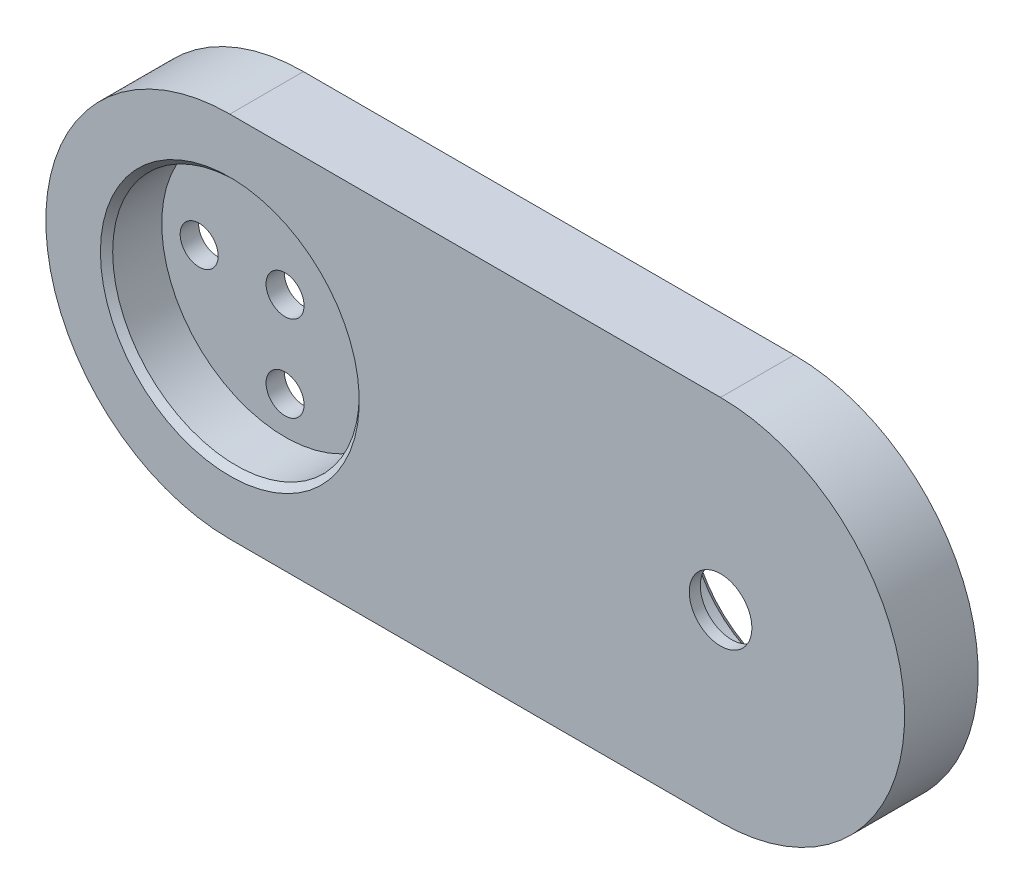
ISO-10303-21;
HEADER;
FILE_DESCRIPTION(('STEP AP214'),'2;1');
FILE_NAME('part.step','',(''),(''),'','','');
FILE_SCHEMA(('AUTOMOTIVE_DESIGN { 1 0 10303 214 1 1 1 1 }'));
ENDSEC;
DATA;
#1=APPLICATION_CONTEXT('core data for automotive mechanical design processes');
#2=APPLICATION_PROTOCOL_DEFINITION('international standard','automotive_design',2000,#1);
#3=PRODUCT_CONTEXT('',#1,'mechanical');
#4=PRODUCT('Part','Part','',(#3));
#5=PRODUCT_RELATED_PRODUCT_CATEGORY('part','',(#4));
#6=PRODUCT_DEFINITION_FORMATION('','',#4);
#7=PRODUCT_DEFINITION_CONTEXT('part definition',#1,'design');
#8=PRODUCT_DEFINITION('design','',#6,#7);
#9=PRODUCT_DEFINITION_SHAPE('','',#8);
#10=(LENGTH_UNIT() NAMED_UNIT(*) SI_UNIT(.MILLI.,.METRE.));
#11=(NAMED_UNIT(*) PLANE_ANGLE_UNIT() SI_UNIT($,.RADIAN.));
#12=(NAMED_UNIT(*) SI_UNIT($,.STERADIAN.) SOLID_ANGLE_UNIT());
#13=UNCERTAINTY_MEASURE_WITH_UNIT(LENGTH_MEASURE(1.E-05),#10,'distance_accuracy_value','');
#14=(GEOMETRIC_REPRESENTATION_CONTEXT(3) GLOBAL_UNCERTAINTY_ASSIGNED_CONTEXT((#13)) GLOBAL_UNIT_ASSIGNED_CONTEXT((#10,
#11,#12)) REPRESENTATION_CONTEXT('',''));
#15=CARTESIAN_POINT('',(0.,0.,0.));
#16=DIRECTION('',(0.,0.,1.));
#17=DIRECTION('',(1.,0.,0.));
#18=AXIS2_PLACEMENT_3D('',#15,#16,#17);
#19=CARTESIAN_POINT('',(-20.,0.,6.));
#20=DIRECTION('',(0.,0.,-1.));
#21=DIRECTION('',(-1.,0.,0.));
#22=AXIS2_PLACEMENT_3D('',#19,#20,#21);
#23=CYLINDRICAL_SURFACE('',#22,15.);
#24=CARTESIAN_POINT('',(-20.,0.,0.));
#25=DIRECTION('',(0.,0.,1.));
#26=DIRECTION('',(-1.,0.,0.));
#27=AXIS2_PLACEMENT_3D('',#24,#25,#26);
#28=CIRCLE('',#27,15.);
#29=CARTESIAN_POINT('',(-20.,15.,0.));
#30=VERTEX_POINT('',#29);
#31=CARTESIAN_POINT('',(-20.,-15.,0.));
#32=VERTEX_POINT('',#31);
#33=EDGE_CURVE('E121',#30,#32,#28,.T.);
#34=ORIENTED_EDGE('',*,*,#33,.T.);
#35=DIRECTION('',(0.,0.,-1.));
#36=VECTOR('',#35,1.);
#37=CARTESIAN_POINT('',(-20.,-15.,6.));
#38=LINE('',#37,#36);
#39=CARTESIAN_POINT('',(-20.,-15.,6.));
#40=VERTEX_POINT('',#39);
#41=EDGE_CURVE('E110',#40,#32,#38,.T.);
#42=ORIENTED_EDGE('',*,*,#41,.F.);
#43=CARTESIAN_POINT('',(-20.,0.,6.));
#44=DIRECTION('',(0.,0.,1.));
#45=DIRECTION('',(-1.,0.,0.));
#46=AXIS2_PLACEMENT_3D('',#43,#44,#45);
#47=CIRCLE('',#46,15.);
#48=CARTESIAN_POINT('',(-20.,15.,6.));
#49=VERTEX_POINT('',#48);
#50=EDGE_CURVE('E102',#49,#40,#47,.T.);
#51=ORIENTED_EDGE('',*,*,#50,.F.);
#52=DIRECTION('',(0.,0.,-1.));
#53=VECTOR('',#52,1.);
#54=CARTESIAN_POINT('',(-20.,15.,6.));
#55=LINE('',#54,#53);
#56=EDGE_CURVE('E117',#49,#30,#55,.T.);
#57=ORIENTED_EDGE('',*,*,#56,.T.);
#58=EDGE_LOOP('',(#34,#42,#51,#57));
#59=FACE_BOUND('',#58,.T.);
#60=ADVANCED_FACE('F47',(#59),#23,.T.);
#61=CARTESIAN_POINT('',(20.,-15.,6.));
#62=DIRECTION('',(0.,1.,0.));
#63=DIRECTION('',(0.,0.,1.));
#64=AXIS2_PLACEMENT_3D('',#61,#62,#63);
#65=PLANE('',#64);
#66=DIRECTION('',(1.,0.,0.));
#67=VECTOR('',#66,1.);
#68=CARTESIAN_POINT('',(20.,-15.,0.));
#69=LINE('',#68,#67);
#70=CARTESIAN_POINT('',(20.,-15.,0.));
#71=VERTEX_POINT('',#70);
#72=EDGE_CURVE('E108',#32,#71,#69,.T.);
#73=ORIENTED_EDGE('',*,*,#72,.T.);
#74=DIRECTION('',(0.,0.,-1.));
#75=VECTOR('',#74,1.);
#76=CARTESIAN_POINT('',(20.,-15.,6.));
#77=LINE('',#76,#75);
#78=CARTESIAN_POINT('',(20.,-15.,6.));
#79=VERTEX_POINT('',#78);
#80=EDGE_CURVE('E106',#79,#71,#77,.T.);
#81=ORIENTED_EDGE('',*,*,#80,.F.);
#82=DIRECTION('',(1.,0.,0.));
#83=VECTOR('',#82,1.);
#84=CARTESIAN_POINT('',(20.,-15.,6.));
#85=LINE('',#84,#83);
#86=EDGE_CURVE('E97',#40,#79,#85,.T.);
#87=ORIENTED_EDGE('',*,*,#86,.F.);
#88=ORIENTED_EDGE('',*,*,#41,.T.);
#89=EDGE_LOOP('',(#73,#81,#87,#88));
#90=FACE_BOUND('',#89,.T.);
#91=ADVANCED_FACE('F107',(#90),#65,.F.);
#92=CARTESIAN_POINT('',(20.,0.,6.));
#93=DIRECTION('',(0.,0.,-1.));
#94=DIRECTION('',(-1.,0.,0.));
#95=AXIS2_PLACEMENT_3D('',#92,#93,#94);
#96=CYLINDRICAL_SURFACE('',#95,15.);
#97=CARTESIAN_POINT('',(20.,0.,0.));
#98=DIRECTION('',(0.,0.,1.));
#99=DIRECTION('',(-1.,0.,0.));
#100=AXIS2_PLACEMENT_3D('',#97,#98,#99);
#101=CIRCLE('',#100,15.);
#102=CARTESIAN_POINT('',(20.,15.,0.));
#103=VERTEX_POINT('',#102);
#104=EDGE_CURVE('E83',#71,#103,#101,.T.);
#105=ORIENTED_EDGE('',*,*,#104,.T.);
#106=DIRECTION('',(0.,0.,-1.));
#107=VECTOR('',#106,1.);
#108=CARTESIAN_POINT('',(20.,15.,6.));
#109=LINE('',#108,#107);
#110=CARTESIAN_POINT('',(20.,15.,6.));
#111=VERTEX_POINT('',#110);
#112=EDGE_CURVE('E111',#111,#103,#109,.T.);
#113=ORIENTED_EDGE('',*,*,#112,.F.);
#114=CARTESIAN_POINT('',(20.,0.,6.));
#115=DIRECTION('',(0.,0.,1.));
#116=DIRECTION('',(-1.,0.,0.));
#117=AXIS2_PLACEMENT_3D('',#114,#115,#116);
#118=CIRCLE('',#117,15.);
#119=EDGE_CURVE('E100',#79,#111,#118,.T.);
#120=ORIENTED_EDGE('',*,*,#119,.F.);
#121=ORIENTED_EDGE('',*,*,#80,.T.);
#122=EDGE_LOOP('',(#105,#113,#120,#121));
#123=FACE_BOUND('',#122,.T.);
#124=ADVANCED_FACE('F113',(#123),#96,.T.);
#125=CARTESIAN_POINT('',(-20.,15.,6.));
#126=DIRECTION('',(0.,-1.,0.));
#127=DIRECTION('',(0.,0.,-1.));
#128=AXIS2_PLACEMENT_3D('',#125,#126,#127);
#129=PLANE('',#128);
#130=DIRECTION('',(-1.,0.,0.));
#131=VECTOR('',#130,1.);
#132=CARTESIAN_POINT('',(-20.,15.,0.));
#133=LINE('',#132,#131);
#134=EDGE_CURVE('E89',#103,#30,#133,.T.);
#135=ORIENTED_EDGE('',*,*,#134,.T.);
#136=ORIENTED_EDGE('',*,*,#56,.F.);
#137=DIRECTION('',(-1.,0.,0.));
#138=VECTOR('',#137,1.);
#139=CARTESIAN_POINT('',(-20.,15.,6.));
#140=LINE('',#139,#138);
#141=EDGE_CURVE('E66',#111,#49,#140,.T.);
#142=ORIENTED_EDGE('',*,*,#141,.F.);
#143=ORIENTED_EDGE('',*,*,#112,.T.);
#144=EDGE_LOOP('',(#135,#136,#142,#143));
#145=FACE_BOUND('',#144,.T.);
#146=ADVANCED_FACE('F176',(#145),#129,.F.);
#147=CARTESIAN_POINT('',(-20.,0.,6.));
#148=DIRECTION('',(0.,0.,-1.));
#149=DIRECTION('',(-1.,0.,0.));
#150=AXIS2_PLACEMENT_3D('',#147,#148,#149);
#151=PLANE('',#150);
#152=CARTESIAN_POINT('',(-20.,0.,6.));
#153=DIRECTION('',(0.,0.,-1.));
#154=DIRECTION('',(-1.,0.,0.));
#155=AXIS2_PLACEMENT_3D('',#152,#153,#154);
#156=CIRCLE('',#155,10.55);
#157=CARTESIAN_POINT('',(-30.55,0.,6.));
#158=VERTEX_POINT('',#157);
#159=EDGE_CURVE('E11',#158,#158,#156,.T.);
#160=ORIENTED_EDGE('',*,*,#159,.T.);
#161=EDGE_LOOP('',(#160));
#162=FACE_BOUND('',#161,.T.);
#163=CARTESIAN_POINT('',(20.,0.,6.));
#164=DIRECTION('',(0.,0.,-1.));
#165=DIRECTION('',(-1.,0.,0.));
#166=AXIS2_PLACEMENT_3D('',#163,#164,#165);
#167=CIRCLE('',#166,2.55);
#168=CARTESIAN_POINT('',(17.45,0.,6.));
#169=VERTEX_POINT('',#168);
#170=EDGE_CURVE('E270',#169,#169,#167,.T.);
#171=ORIENTED_EDGE('',*,*,#170,.T.);
#172=EDGE_LOOP('',(#171));
#173=FACE_BOUND('',#172,.T.);
#174=ORIENTED_EDGE('',*,*,#50,.T.);
#175=ORIENTED_EDGE('',*,*,#86,.T.);
#176=ORIENTED_EDGE('',*,*,#119,.T.);
#177=ORIENTED_EDGE('',*,*,#141,.T.);
#178=EDGE_LOOP('',(#174,#175,#176,#177));
#179=FACE_BOUND('',#178,.T.);
#180=ADVANCED_FACE('F98',(#162,#173,#179),#151,.F.);
#181=CARTESIAN_POINT('',(-20.,0.,0.));
#182=DIRECTION('',(0.,0.,-1.));
#183=DIRECTION('',(-1.,0.,0.));
#184=AXIS2_PLACEMENT_3D('',#181,#182,#183);
#185=PLANE('',#184);
#186=CARTESIAN_POINT('',(20.,0.,0.));
#187=DIRECTION('',(0.,0.,-1.));
#188=DIRECTION('',(-1.,0.,0.));
#189=AXIS2_PLACEMENT_3D('',#186,#187,#188);
#190=CIRCLE('',#189,8.475);
#191=CARTESIAN_POINT('',(11.525,0.,0.));
#192=VERTEX_POINT('',#191);
#193=EDGE_CURVE('E142',#192,#192,#190,.F.);
#194=ORIENTED_EDGE('',*,*,#193,.T.);
#195=EDGE_LOOP('',(#194));
#196=FACE_BOUND('',#195,.T.);
#197=CARTESIAN_POINT('',(-13.,0.,0.));
#198=DIRECTION('',(0.,0.,1.));
#199=DIRECTION('',(1.,0.,0.));
#200=AXIS2_PLACEMENT_3D('',#197,#198,#199);
#201=CIRCLE('',#200,1.55);
#202=CARTESIAN_POINT('',(-11.45,0.,0.));
#203=VERTEX_POINT('',#202);
#204=EDGE_CURVE('E255',#203,#203,#201,.T.);
#205=ORIENTED_EDGE('',*,*,#204,.T.);
#206=EDGE_LOOP('',(#205));
#207=FACE_BOUND('',#206,.T.);
#208=CARTESIAN_POINT('',(-27.,0.,0.));
#209=DIRECTION('',(0.,0.,1.));
#210=DIRECTION('',(1.,0.,0.));
#211=AXIS2_PLACEMENT_3D('',#208,#209,#210);
#212=CIRCLE('',#211,1.55);
#213=CARTESIAN_POINT('',(-25.45,0.,0.));
#214=VERTEX_POINT('',#213);
#215=EDGE_CURVE('E233',#214,#214,#212,.T.);
#216=ORIENTED_EDGE('',*,*,#215,.T.);
#217=EDGE_LOOP('',(#216));
#218=FACE_BOUND('',#217,.T.);
#219=CARTESIAN_POINT('',(-20.,7.,0.));
#220=DIRECTION('',(0.,0.,1.));
#221=DIRECTION('',(1.,0.,0.));
#222=AXIS2_PLACEMENT_3D('',#219,#220,#221);
#223=CIRCLE('',#222,1.55);
#224=CARTESIAN_POINT('',(-18.45,7.,0.));
#225=VERTEX_POINT('',#224);
#226=EDGE_CURVE('E227',#225,#225,#223,.T.);
#227=ORIENTED_EDGE('',*,*,#226,.T.);
#228=EDGE_LOOP('',(#227));
#229=FACE_BOUND('',#228,.T.);
#230=CARTESIAN_POINT('',(-20.,-7.,0.));
#231=DIRECTION('',(0.,0.,1.));
#232=DIRECTION('',(1.,0.,0.));
#233=AXIS2_PLACEMENT_3D('',#230,#231,#232);
#234=CIRCLE('',#233,1.55);
#235=CARTESIAN_POINT('',(-18.45,-7.,0.));
#236=VERTEX_POINT('',#235);
#237=EDGE_CURVE('E246',#236,#236,#234,.T.);
#238=ORIENTED_EDGE('',*,*,#237,.T.);
#239=EDGE_LOOP('',(#238));
#240=FACE_BOUND('',#239,.T.);
#241=CARTESIAN_POINT('',(-20.,0.,0.));
#242=DIRECTION('',(0.,0.,1.));
#243=DIRECTION('',(1.,0.,0.));
#244=AXIS2_PLACEMENT_3D('',#241,#242,#243);
#245=CIRCLE('',#244,1.55);
#246=CARTESIAN_POINT('',(-18.45,0.,0.));
#247=VERTEX_POINT('',#246);
#248=EDGE_CURVE('E262',#247,#247,#245,.T.);
#249=ORIENTED_EDGE('',*,*,#248,.T.);
#250=EDGE_LOOP('',(#249));
#251=FACE_BOUND('',#250,.T.);
#252=ORIENTED_EDGE('',*,*,#33,.F.);
#253=ORIENTED_EDGE('',*,*,#134,.F.);
#254=ORIENTED_EDGE('',*,*,#104,.F.);
#255=ORIENTED_EDGE('',*,*,#72,.F.);
#256=EDGE_LOOP('',(#252,#253,#254,#255));
#257=FACE_BOUND('',#256,.T.);
#258=ADVANCED_FACE('F179',(#196,#207,#218,#229,#240,#251,#257),#185,.T.);
#259=CARTESIAN_POINT('',(-20.,0.,1.5));
#260=DIRECTION('',(0.,0.,1.));
#261=DIRECTION('',(1.,0.,0.));
#262=AXIS2_PLACEMENT_3D('',#259,#260,#261);
#263=CYLINDRICAL_SURFACE('',#262,10.05);
#264=CARTESIAN_POINT('',(-20.,0.,5.50000000000001));
#265=DIRECTION('',(0.,0.,-1.));
#266=DIRECTION('',(-1.,0.,0.));
#267=AXIS2_PLACEMENT_3D('',#264,#265,#266);
#268=CIRCLE('',#267,10.05);
#269=CARTESIAN_POINT('',(-30.05,0.,5.50000000000001));
#270=VERTEX_POINT('',#269);
#271=EDGE_CURVE('E58',#270,#270,#268,.F.);
#272=ORIENTED_EDGE('',*,*,#271,.T.);
#273=EDGE_LOOP('',(#272));
#274=FACE_BOUND('',#273,.T.);
#275=CARTESIAN_POINT('',(-20.,0.,1.5));
#276=DIRECTION('',(0.,0.,1.));
#277=DIRECTION('',(1.,0.,0.));
#278=AXIS2_PLACEMENT_3D('',#275,#276,#277);
#279=CIRCLE('',#278,10.05);
#280=CARTESIAN_POINT('',(-9.95,0.,1.5));
#281=VERTEX_POINT('',#280);
#282=EDGE_CURVE('E125',#281,#281,#279,.T.);
#283=ORIENTED_EDGE('',*,*,#282,.F.);
#284=EDGE_LOOP('',(#283));
#285=FACE_BOUND('',#284,.T.);
#286=ADVANCED_FACE('F149',(#274,#285),#263,.F.);
#287=CARTESIAN_POINT('',(-20.,0.,1.5));
#288=DIRECTION('',(0.,0.,1.));
#289=DIRECTION('',(1.,0.,0.));
#290=AXIS2_PLACEMENT_3D('',#287,#288,#289);
#291=PLANE('',#290);
#292=CARTESIAN_POINT('',(-20.,0.,1.5));
#293=DIRECTION('',(0.,0.,1.));
#294=DIRECTION('',(1.,0.,0.));
#295=AXIS2_PLACEMENT_3D('',#292,#293,#294);
#296=CIRCLE('',#295,1.55);
#297=CARTESIAN_POINT('',(-18.45,0.,1.5));
#298=VERTEX_POINT('',#297);
#299=EDGE_CURVE('E254',#298,#298,#296,.T.);
#300=ORIENTED_EDGE('',*,*,#299,.F.);
#301=EDGE_LOOP('',(#300));
#302=FACE_BOUND('',#301,.T.);
#303=CARTESIAN_POINT('',(-13.,0.,1.5));
#304=DIRECTION('',(0.,0.,1.));
#305=DIRECTION('',(1.,0.,0.));
#306=AXIS2_PLACEMENT_3D('',#303,#304,#305);
#307=CIRCLE('',#306,1.55);
#308=CARTESIAN_POINT('',(-11.45,0.,1.5));
#309=VERTEX_POINT('',#308);
#310=EDGE_CURVE('E250',#309,#309,#307,.T.);
#311=ORIENTED_EDGE('',*,*,#310,.F.);
#312=EDGE_LOOP('',(#311));
#313=FACE_BOUND('',#312,.T.);
#314=CARTESIAN_POINT('',(-27.,0.,1.5));
#315=DIRECTION('',(0.,0.,1.));
#316=DIRECTION('',(1.,0.,0.));
#317=AXIS2_PLACEMENT_3D('',#314,#315,#316);
#318=CIRCLE('',#317,1.55);
#319=CARTESIAN_POINT('',(-25.45,0.,1.5));
#320=VERTEX_POINT('',#319);
#321=EDGE_CURVE('E238',#320,#320,#318,.T.);
#322=ORIENTED_EDGE('',*,*,#321,.F.);
#323=EDGE_LOOP('',(#322));
#324=FACE_BOUND('',#323,.T.);
#325=CARTESIAN_POINT('',(-20.,7.,1.5));
#326=DIRECTION('',(0.,0.,1.));
#327=DIRECTION('',(1.,0.,0.));
#328=AXIS2_PLACEMENT_3D('',#325,#326,#327);
#329=CIRCLE('',#328,1.55);
#330=CARTESIAN_POINT('',(-18.45,7.,1.5));
#331=VERTEX_POINT('',#330);
#332=EDGE_CURVE('E230',#331,#331,#329,.T.);
#333=ORIENTED_EDGE('',*,*,#332,.F.);
#334=EDGE_LOOP('',(#333));
#335=FACE_BOUND('',#334,.T.);
#336=CARTESIAN_POINT('',(-20.,-7.,1.5));
#337=DIRECTION('',(0.,0.,1.));
#338=DIRECTION('',(1.,0.,0.));
#339=AXIS2_PLACEMENT_3D('',#336,#337,#338);
#340=CIRCLE('',#339,1.55);
#341=CARTESIAN_POINT('',(-18.45,-7.,1.5));
#342=VERTEX_POINT('',#341);
#343=EDGE_CURVE('E240',#342,#342,#340,.T.);
#344=ORIENTED_EDGE('',*,*,#343,.F.);
#345=EDGE_LOOP('',(#344));
#346=FACE_BOUND('',#345,.T.);
#347=ORIENTED_EDGE('',*,*,#282,.T.);
#348=EDGE_LOOP('',(#347));
#349=FACE_BOUND('',#348,.T.);
#350=ADVANCED_FACE('F188',(#302,#313,#324,#335,#346,#349),#291,.T.);
#351=CARTESIAN_POINT('',(20.,0.,5.1));
#352=DIRECTION('',(0.,0.,-1.));
#353=DIRECTION('',(-1.,0.,0.));
#354=AXIS2_PLACEMENT_3D('',#351,#352,#353);
#355=CYLINDRICAL_SURFACE('',#354,7.975);
#356=CARTESIAN_POINT('',(20.,0.,0.499999999999997));
#357=DIRECTION('',(0.,0.,-1.));
#358=DIRECTION('',(-1.,0.,0.));
#359=AXIS2_PLACEMENT_3D('',#356,#357,#358);
#360=CIRCLE('',#359,7.975);
#361=CARTESIAN_POINT('',(12.025,0.,0.499999999999997));
#362=VERTEX_POINT('',#361);
#363=EDGE_CURVE('E138',#362,#362,#360,.T.);
#364=ORIENTED_EDGE('',*,*,#363,.T.);
#365=EDGE_LOOP('',(#364));
#366=FACE_BOUND('',#365,.T.);
#367=CARTESIAN_POINT('',(20.,0.,5.1));
#368=DIRECTION('',(0.,0.,-1.));
#369=DIRECTION('',(-1.,0.,0.));
#370=AXIS2_PLACEMENT_3D('',#367,#368,#369);
#371=CIRCLE('',#370,7.975);
#372=CARTESIAN_POINT('',(12.025,0.,5.1));
#373=VERTEX_POINT('',#372);
#374=EDGE_CURVE('E274',#373,#373,#371,.T.);
#375=ORIENTED_EDGE('',*,*,#374,.F.);
#376=EDGE_LOOP('',(#375));
#377=FACE_BOUND('',#376,.T.);
#378=ADVANCED_FACE('F191',(#366,#377),#355,.F.);
#379=CARTESIAN_POINT('',(20.,0.,5.1));
#380=DIRECTION('',(0.,0.,-1.));
#381=DIRECTION('',(-1.,0.,0.));
#382=AXIS2_PLACEMENT_3D('',#379,#380,#381);
#383=PLANE('',#382);
#384=CARTESIAN_POINT('',(20.,0.,5.1));
#385=DIRECTION('',(0.,0.,-1.));
#386=DIRECTION('',(-1.,0.,0.));
#387=AXIS2_PLACEMENT_3D('',#384,#385,#386);
#388=CIRCLE('',#387,2.55);
#389=CARTESIAN_POINT('',(17.45,0.,5.1));
#390=VERTEX_POINT('',#389);
#391=EDGE_CURVE('E266',#390,#390,#388,.T.);
#392=ORIENTED_EDGE('',*,*,#391,.F.);
#393=EDGE_LOOP('',(#392));
#394=FACE_BOUND('',#393,.T.);
#395=ORIENTED_EDGE('',*,*,#374,.T.);
#396=EDGE_LOOP('',(#395));
#397=FACE_BOUND('',#396,.T.);
#398=ADVANCED_FACE('F195',(#394,#397),#383,.T.);
#399=CARTESIAN_POINT('',(20.,0.,6.));
#400=DIRECTION('',(0.,0.,-1.));
#401=DIRECTION('',(-1.,0.,0.));
#402=AXIS2_PLACEMENT_3D('',#399,#400,#401);
#403=CYLINDRICAL_SURFACE('',#402,2.55);
#404=ORIENTED_EDGE('',*,*,#170,.F.);
#405=EDGE_LOOP('',(#404));
#406=FACE_BOUND('',#405,.T.);
#407=ORIENTED_EDGE('',*,*,#391,.T.);
#408=EDGE_LOOP('',(#407));
#409=FACE_BOUND('',#408,.T.);
#410=ADVANCED_FACE('F199',(#406,#409),#403,.F.);
#411=CARTESIAN_POINT('',(-20.,-7.,0.));
#412=DIRECTION('',(0.,0.,1.));
#413=DIRECTION('',(1.,0.,0.));
#414=AXIS2_PLACEMENT_3D('',#411,#412,#413);
#415=CYLINDRICAL_SURFACE('',#414,1.55);
#416=ORIENTED_EDGE('',*,*,#237,.F.);
#417=EDGE_LOOP('',(#416));
#418=FACE_BOUND('',#417,.T.);
#419=ORIENTED_EDGE('',*,*,#343,.T.);
#420=EDGE_LOOP('',(#419));
#421=FACE_BOUND('',#420,.T.);
#422=ADVANCED_FACE('F203',(#418,#421),#415,.F.);
#423=CARTESIAN_POINT('',(-20.,7.,0.));
#424=DIRECTION('',(0.,0.,1.));
#425=DIRECTION('',(1.,0.,0.));
#426=AXIS2_PLACEMENT_3D('',#423,#424,#425);
#427=CYLINDRICAL_SURFACE('',#426,1.55);
#428=ORIENTED_EDGE('',*,*,#226,.F.);
#429=EDGE_LOOP('',(#428));
#430=FACE_BOUND('',#429,.T.);
#431=ORIENTED_EDGE('',*,*,#332,.T.);
#432=EDGE_LOOP('',(#431));
#433=FACE_BOUND('',#432,.T.);
#434=ADVANCED_FACE('F212',(#430,#433),#427,.F.);
#435=CARTESIAN_POINT('',(-27.,0.,0.));
#436=DIRECTION('',(0.,0.,1.));
#437=DIRECTION('',(1.,0.,0.));
#438=AXIS2_PLACEMENT_3D('',#435,#436,#437);
#439=CYLINDRICAL_SURFACE('',#438,1.55);
#440=ORIENTED_EDGE('',*,*,#215,.F.);
#441=EDGE_LOOP('',(#440));
#442=FACE_BOUND('',#441,.T.);
#443=ORIENTED_EDGE('',*,*,#321,.T.);
#444=EDGE_LOOP('',(#443));
#445=FACE_BOUND('',#444,.T.);
#446=ADVANCED_FACE('F209',(#442,#445),#439,.F.);
#447=CARTESIAN_POINT('',(-13.,0.,0.));
#448=DIRECTION('',(0.,0.,1.));
#449=DIRECTION('',(1.,0.,0.));
#450=AXIS2_PLACEMENT_3D('',#447,#448,#449);
#451=CYLINDRICAL_SURFACE('',#450,1.55);
#452=ORIENTED_EDGE('',*,*,#204,.F.);
#453=EDGE_LOOP('',(#452));
#454=FACE_BOUND('',#453,.T.);
#455=ORIENTED_EDGE('',*,*,#310,.T.);
#456=EDGE_LOOP('',(#455));
#457=FACE_BOUND('',#456,.T.);
#458=ADVANCED_FACE('F207',(#454,#457),#451,.F.);
#459=CARTESIAN_POINT('',(-20.,0.,0.));
#460=DIRECTION('',(0.,0.,1.));
#461=DIRECTION('',(1.,0.,0.));
#462=AXIS2_PLACEMENT_3D('',#459,#460,#461);
#463=CYLINDRICAL_SURFACE('',#462,1.55);
#464=ORIENTED_EDGE('',*,*,#248,.F.);
#465=EDGE_LOOP('',(#464));
#466=FACE_BOUND('',#465,.T.);
#467=ORIENTED_EDGE('',*,*,#299,.T.);
#468=EDGE_LOOP('',(#467));
#469=FACE_BOUND('',#468,.T.);
#470=ADVANCED_FACE('F158',(#466,#469),#463,.F.);
#471=CARTESIAN_POINT('',(20.,0.,0.499999999999997));
#472=DIRECTION('',(0.,0.,-1.));
#473=DIRECTION('',(-1.,0.,0.));
#474=AXIS2_PLACEMENT_3D('',#471,#472,#473);
#475=CONICAL_SURFACE('',#474,7.975,0.785398163397455);
#476=ORIENTED_EDGE('',*,*,#193,.F.);
#477=EDGE_LOOP('',(#476));
#478=FACE_BOUND('',#477,.T.);
#479=ORIENTED_EDGE('',*,*,#363,.F.);
#480=EDGE_LOOP('',(#479));
#481=FACE_BOUND('',#480,.T.);
#482=ADVANCED_FACE('F153',(#478,#481),#475,.F.);
#483=CARTESIAN_POINT('',(-20.,0.,5.50000000000001));
#484=DIRECTION('',(0.,0.,1.));
#485=DIRECTION('',(1.,0.,0.));
#486=AXIS2_PLACEMENT_3D('',#483,#484,#485);
#487=CONICAL_SURFACE('',#486,10.05,0.785398163397459);
#488=ORIENTED_EDGE('',*,*,#159,.F.);
#489=EDGE_LOOP('',(#488));
#490=FACE_BOUND('',#489,.T.);
#491=ORIENTED_EDGE('',*,*,#271,.F.);
#492=EDGE_LOOP('',(#491));
#493=FACE_BOUND('',#492,.T.);
#494=ADVANCED_FACE('F50',(#490,#493),#487,.F.);
#495=CLOSED_SHELL('',(#60,#91,#124,#146,#180,#258,#286,#350,#378,#398,#410,#422,#434,#446,#458,
#470,#482,#494));
#496=MANIFOLD_SOLID_BREP('B2',#495);
#497=ADVANCED_BREP_SHAPE_REPRESENTATION('',(#18,#496),#14);
#498=SHAPE_DEFINITION_REPRESENTATION(#9,#497);
ENDSEC;
END-ISO-10303-21;
